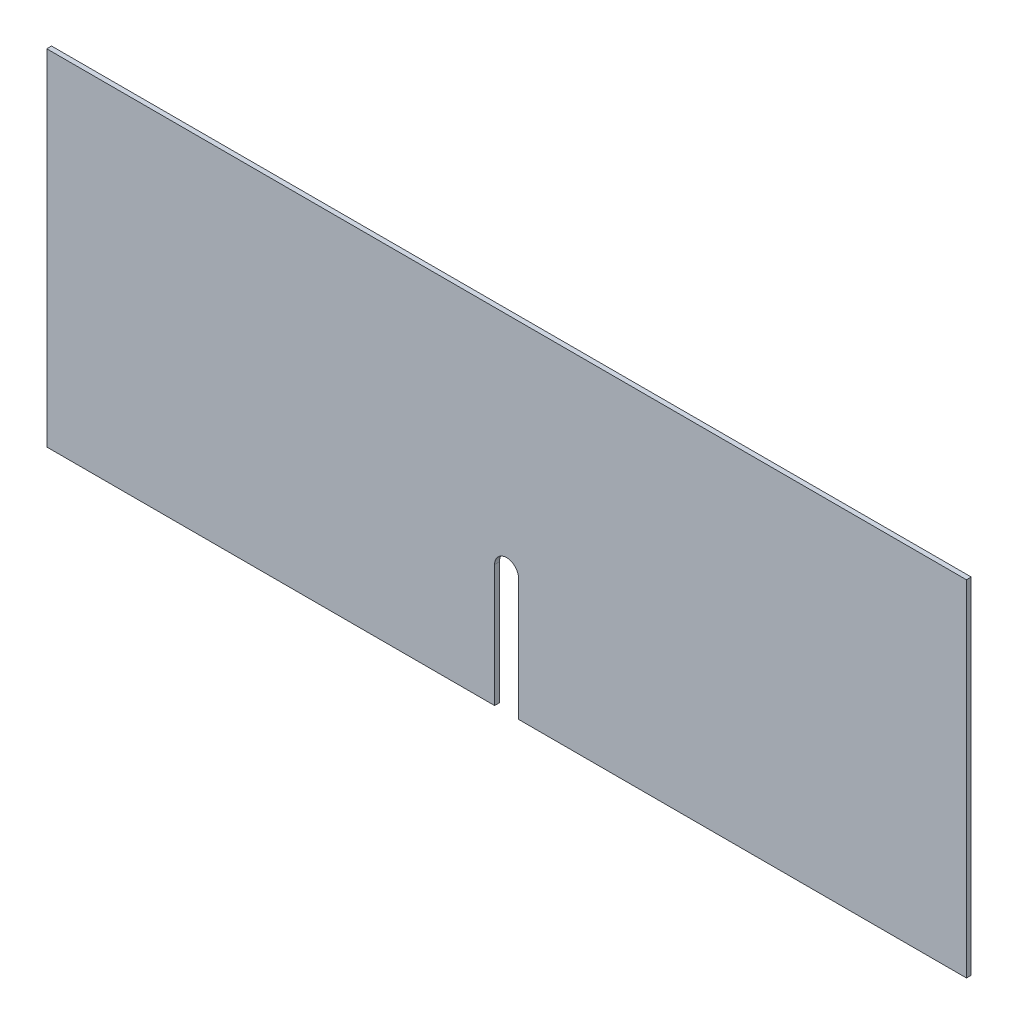
ISO-10303-21;
HEADER;
FILE_DESCRIPTION(('STEP AP214'),'2;1');
FILE_NAME('part.step','',(''),(''),'','','');
FILE_SCHEMA(('AUTOMOTIVE_DESIGN { 1 0 10303 214 1 1 1 1 }'));
ENDSEC;
DATA;
#1=APPLICATION_CONTEXT('core data for automotive mechanical design processes');
#2=APPLICATION_PROTOCOL_DEFINITION('international standard','automotive_design',2000,#1);
#3=PRODUCT_CONTEXT('',#1,'mechanical');
#4=PRODUCT('Part','Part','',(#3));
#5=PRODUCT_RELATED_PRODUCT_CATEGORY('part','',(#4));
#6=PRODUCT_DEFINITION_FORMATION('','',#4);
#7=PRODUCT_DEFINITION_CONTEXT('part definition',#1,'design');
#8=PRODUCT_DEFINITION('design','',#6,#7);
#9=PRODUCT_DEFINITION_SHAPE('','',#8);
#10=(LENGTH_UNIT() NAMED_UNIT(*) SI_UNIT(.MILLI.,.METRE.));
#11=(NAMED_UNIT(*) PLANE_ANGLE_UNIT() SI_UNIT($,.RADIAN.));
#12=(NAMED_UNIT(*) SI_UNIT($,.STERADIAN.) SOLID_ANGLE_UNIT());
#13=UNCERTAINTY_MEASURE_WITH_UNIT(LENGTH_MEASURE(1.E-05),#10,'distance_accuracy_value','');
#14=(GEOMETRIC_REPRESENTATION_CONTEXT(3) GLOBAL_UNCERTAINTY_ASSIGNED_CONTEXT((#13)) GLOBAL_UNIT_ASSIGNED_CONTEXT((#10,
#11,#12)) REPRESENTATION_CONTEXT('',''));
#15=CARTESIAN_POINT('',(0.,0.,0.));
#16=DIRECTION('',(0.,0.,1.));
#17=DIRECTION('',(1.,0.,0.));
#18=AXIS2_PLACEMENT_3D('',#15,#16,#17);
#19=CARTESIAN_POINT('',(277.715474090151,-96.8844194508236,0.));
#20=DIRECTION('',(0.,0.,1.));
#21=DIRECTION('',(1.,0.,0.));
#22=AXIS2_PLACEMENT_3D('',#19,#20,#21);
#23=PLANE('',#22);
#24=DIRECTION('',(1.,0.,0.));
#25=VECTOR('',#24,1.);
#26=CARTESIAN_POINT('',(582.515474090151,-205.307848770144,0.));
#27=LINE('',#26,#25);
#28=CARTESIAN_POINT('',(285.652974090151,-205.307848770144,0.));
#29=VERTEX_POINT('',#28);
#30=CARTESIAN_POINT('',(582.515474090151,-205.307848770144,0.));
#31=VERTEX_POINT('',#30);
#32=EDGE_CURVE('E85',#29,#31,#27,.T.);
#33=ORIENTED_EDGE('',*,*,#32,.F.);
#34=DIRECTION('',(0.,1.,0.));
#35=VECTOR('',#34,1.);
#36=CARTESIAN_POINT('',(285.652974090151,-205.307848770144,0.));
#37=LINE('',#36,#35);
#38=CARTESIAN_POINT('',(285.652974090151,-124.345348770144,0.));
#39=VERTEX_POINT('',#38);
#40=EDGE_CURVE('E53',#39,#29,#37,.F.);
#41=ORIENTED_EDGE('',*,*,#40,.F.);
#42=CARTESIAN_POINT('',(277.715474090151,-124.345348770144,0.));
#43=DIRECTION('',(0.,0.,1.));
#44=DIRECTION('',(1.,0.,0.));
#45=AXIS2_PLACEMENT_3D('',#42,#43,#44);
#46=CIRCLE('',#45,7.9375);
#47=CARTESIAN_POINT('',(269.777974090151,-124.345348770144,0.));
#48=VERTEX_POINT('',#47);
#49=EDGE_CURVE('E20',#39,#48,#46,.T.);
#50=ORIENTED_EDGE('',*,*,#49,.T.);
#51=DIRECTION('',(0.,1.,0.));
#52=VECTOR('',#51,1.);
#53=CARTESIAN_POINT('',(269.777974090151,-124.345348770144,0.));
#54=LINE('',#53,#52);
#55=CARTESIAN_POINT('',(269.777974090151,-205.307848770144,0.));
#56=VERTEX_POINT('',#55);
#57=EDGE_CURVE('E59',#56,#48,#54,.T.);
#58=ORIENTED_EDGE('',*,*,#57,.F.);
#59=DIRECTION('',(1.,0.,0.));
#60=VECTOR('',#59,1.);
#61=CARTESIAN_POINT('',(269.777974090151,-205.307848770144,0.));
#62=LINE('',#61,#60);
#63=CARTESIAN_POINT('',(-27.0845259098492,-205.307848770144,0.));
#64=VERTEX_POINT('',#63);
#65=EDGE_CURVE('E118',#64,#56,#62,.T.);
#66=ORIENTED_EDGE('',*,*,#65,.F.);
#67=DIRECTION('',(0.,1.,0.));
#68=VECTOR('',#67,1.);
#69=CARTESIAN_POINT('',(-27.0845259098492,-205.307848770144,0.));
#70=LINE('',#69,#68);
#71=CARTESIAN_POINT('',(-27.0845259098492,23.2921512298557,0.));
#72=VERTEX_POINT('',#71);
#73=EDGE_CURVE('E123',#72,#64,#70,.F.);
#74=ORIENTED_EDGE('',*,*,#73,.F.);
#75=DIRECTION('',(1.,0.,0.));
#76=VECTOR('',#75,1.);
#77=CARTESIAN_POINT('',(-27.0845259098492,23.2921512298557,0.));
#78=LINE('',#77,#76);
#79=CARTESIAN_POINT('',(582.515474090151,23.2921512298557,0.));
#80=VERTEX_POINT('',#79);
#81=EDGE_CURVE('E129',#80,#72,#78,.F.);
#82=ORIENTED_EDGE('',*,*,#81,.F.);
#83=DIRECTION('',(0.,1.,0.));
#84=VECTOR('',#83,1.);
#85=CARTESIAN_POINT('',(582.515474090151,23.2921512298557,0.));
#86=LINE('',#85,#84);
#87=EDGE_CURVE('E83',#31,#80,#86,.T.);
#88=ORIENTED_EDGE('',*,*,#87,.F.);
#89=EDGE_LOOP('',(#33,#41,#50,#58,#66,#74,#82,#88));
#90=FACE_BOUND('',#89,.T.);
#91=ADVANCED_FACE('F17',(#90),#23,.F.);
#92=CARTESIAN_POINT('',(285.652974090151,-205.307848770144,0.));
#93=DIRECTION('',(-1.,0.,0.));
#94=DIRECTION('',(0.,0.,1.));
#95=AXIS2_PLACEMENT_3D('',#92,#93,#94);
#96=PLANE('',#95);
#97=DIRECTION('',(0.,1.,0.));
#98=VECTOR('',#97,1.);
#99=CARTESIAN_POINT('',(285.652974090151,-96.8844194508236,3.175));
#100=LINE('',#99,#98);
#101=CARTESIAN_POINT('',(285.652974090151,-124.345348770144,3.175));
#102=VERTEX_POINT('',#101);
#103=CARTESIAN_POINT('',(285.652974090151,-205.307848770144,3.175));
#104=VERTEX_POINT('',#103);
#105=EDGE_CURVE('E150',#102,#104,#100,.F.);
#106=ORIENTED_EDGE('',*,*,#105,.F.);
#107=DIRECTION('',(0.,0.,1.));
#108=VECTOR('',#107,1.);
#109=CARTESIAN_POINT('',(285.652974090151,-124.345348770144,0.));
#110=LINE('',#109,#108);
#111=EDGE_CURVE('E95',#102,#39,#110,.F.);
#112=ORIENTED_EDGE('',*,*,#111,.T.);
#113=ORIENTED_EDGE('',*,*,#40,.T.);
#114=DIRECTION('',(0.,0.,-1.));
#115=VECTOR('',#114,1.);
#116=CARTESIAN_POINT('',(285.652974090151,-205.307848770144,0.));
#117=LINE('',#116,#115);
#118=EDGE_CURVE('E89',#104,#29,#117,.T.);
#119=ORIENTED_EDGE('',*,*,#118,.F.);
#120=EDGE_LOOP('',(#106,#112,#113,#119));
#121=FACE_BOUND('',#120,.T.);
#122=ADVANCED_FACE('F92',(#121),#96,.T.);
#123=CARTESIAN_POINT('',(582.515474090151,-205.307848770144,0.));
#124=DIRECTION('',(0.,-1.,0.));
#125=DIRECTION('',(0.,0.,-1.));
#126=AXIS2_PLACEMENT_3D('',#123,#124,#125);
#127=PLANE('',#126);
#128=DIRECTION('',(1.,0.,0.));
#129=VECTOR('',#128,1.);
#130=CARTESIAN_POINT('',(277.715474090151,-205.307848770144,3.175));
#131=LINE('',#130,#129);
#132=CARTESIAN_POINT('',(582.515474090151,-205.307848770144,3.175));
#133=VERTEX_POINT('',#132);
#134=EDGE_CURVE('E100',#104,#133,#131,.T.);
#135=ORIENTED_EDGE('',*,*,#134,.F.);
#136=ORIENTED_EDGE('',*,*,#118,.T.);
#137=ORIENTED_EDGE('',*,*,#32,.T.);
#138=DIRECTION('',(0.,0.,-1.));
#139=VECTOR('',#138,1.);
#140=CARTESIAN_POINT('',(582.515474090151,-205.307848770144,0.));
#141=LINE('',#140,#139);
#142=EDGE_CURVE('E103',#133,#31,#141,.T.);
#143=ORIENTED_EDGE('',*,*,#142,.F.);
#144=EDGE_LOOP('',(#135,#136,#137,#143));
#145=FACE_BOUND('',#144,.T.);
#146=ADVANCED_FACE('F98',(#145),#127,.T.);
#147=CARTESIAN_POINT('',(582.515474090151,23.2921512298557,0.));
#148=DIRECTION('',(1.,0.,0.));
#149=DIRECTION('',(0.,0.,-1.));
#150=AXIS2_PLACEMENT_3D('',#147,#148,#149);
#151=PLANE('',#150);
#152=DIRECTION('',(0.,1.,0.));
#153=VECTOR('',#152,1.);
#154=CARTESIAN_POINT('',(582.515474090151,-96.8844194508236,3.175));
#155=LINE('',#154,#153);
#156=CARTESIAN_POINT('',(582.515474090151,23.2921512298557,3.175));
#157=VERTEX_POINT('',#156);
#158=EDGE_CURVE('E149',#133,#157,#155,.T.);
#159=ORIENTED_EDGE('',*,*,#158,.F.);
#160=ORIENTED_EDGE('',*,*,#142,.T.);
#161=ORIENTED_EDGE('',*,*,#87,.T.);
#162=DIRECTION('',(0.,0.,1.));
#163=VECTOR('',#162,1.);
#164=CARTESIAN_POINT('',(582.515474090151,23.2921512298557,0.));
#165=LINE('',#164,#163);
#166=EDGE_CURVE('E126',#157,#80,#165,.F.);
#167=ORIENTED_EDGE('',*,*,#166,.F.);
#168=EDGE_LOOP('',(#159,#160,#161,#167));
#169=FACE_BOUND('',#168,.T.);
#170=ADVANCED_FACE('F219',(#169),#151,.T.);
#171=CARTESIAN_POINT('',(-27.0845259098492,23.2921512298557,0.));
#172=DIRECTION('',(0.,1.,0.));
#173=DIRECTION('',(0.,0.,1.));
#174=AXIS2_PLACEMENT_3D('',#171,#172,#173);
#175=PLANE('',#174);
#176=DIRECTION('',(1.,0.,0.));
#177=VECTOR('',#176,1.);
#178=CARTESIAN_POINT('',(277.715474090151,23.2921512298557,3.175));
#179=LINE('',#178,#177);
#180=CARTESIAN_POINT('',(-27.0845259098492,23.2921512298557,3.175));
#181=VERTEX_POINT('',#180);
#182=EDGE_CURVE('E153',#157,#181,#179,.F.);
#183=ORIENTED_EDGE('',*,*,#182,.F.);
#184=ORIENTED_EDGE('',*,*,#166,.T.);
#185=ORIENTED_EDGE('',*,*,#81,.T.);
#186=DIRECTION('',(0.,0.,1.));
#187=VECTOR('',#186,1.);
#188=CARTESIAN_POINT('',(-27.0845259098492,23.2921512298557,0.));
#189=LINE('',#188,#187);
#190=EDGE_CURVE('E120',#181,#72,#189,.F.);
#191=ORIENTED_EDGE('',*,*,#190,.F.);
#192=EDGE_LOOP('',(#183,#184,#185,#191));
#193=FACE_BOUND('',#192,.T.);
#194=ADVANCED_FACE('F193',(#193),#175,.T.);
#195=CARTESIAN_POINT('',(-27.0845259098492,-205.307848770144,0.));
#196=DIRECTION('',(-1.,0.,0.));
#197=DIRECTION('',(0.,0.,1.));
#198=AXIS2_PLACEMENT_3D('',#195,#196,#197);
#199=PLANE('',#198);
#200=DIRECTION('',(0.,1.,0.));
#201=VECTOR('',#200,1.);
#202=CARTESIAN_POINT('',(-27.0845259098492,-96.8844194508236,3.175));
#203=LINE('',#202,#201);
#204=CARTESIAN_POINT('',(-27.0845259098492,-205.307848770144,3.175));
#205=VERTEX_POINT('',#204);
#206=EDGE_CURVE('E170',#181,#205,#203,.F.);
#207=ORIENTED_EDGE('',*,*,#206,.F.);
#208=ORIENTED_EDGE('',*,*,#190,.T.);
#209=ORIENTED_EDGE('',*,*,#73,.T.);
#210=DIRECTION('',(0.,0.,-1.));
#211=VECTOR('',#210,1.);
#212=CARTESIAN_POINT('',(-27.0845259098492,-205.307848770144,0.));
#213=LINE('',#212,#211);
#214=EDGE_CURVE('E113',#205,#64,#213,.T.);
#215=ORIENTED_EDGE('',*,*,#214,.F.);
#216=EDGE_LOOP('',(#207,#208,#209,#215));
#217=FACE_BOUND('',#216,.T.);
#218=ADVANCED_FACE('F196',(#217),#199,.T.);
#219=CARTESIAN_POINT('',(269.777974090151,-205.307848770144,0.));
#220=DIRECTION('',(0.,-1.,0.));
#221=DIRECTION('',(0.,0.,-1.));
#222=AXIS2_PLACEMENT_3D('',#219,#220,#221);
#223=PLANE('',#222);
#224=DIRECTION('',(1.,0.,0.));
#225=VECTOR('',#224,1.);
#226=CARTESIAN_POINT('',(277.715474090151,-205.307848770144,3.175));
#227=LINE('',#226,#225);
#228=CARTESIAN_POINT('',(269.777974090151,-205.307848770144,3.175));
#229=VERTEX_POINT('',#228);
#230=EDGE_CURVE('E167',#205,#229,#227,.T.);
#231=ORIENTED_EDGE('',*,*,#230,.F.);
#232=ORIENTED_EDGE('',*,*,#214,.T.);
#233=ORIENTED_EDGE('',*,*,#65,.T.);
#234=DIRECTION('',(0.,0.,-1.));
#235=VECTOR('',#234,1.);
#236=CARTESIAN_POINT('',(269.777974090151,-205.307848770144,0.));
#237=LINE('',#236,#235);
#238=EDGE_CURVE('E112',#229,#56,#237,.T.);
#239=ORIENTED_EDGE('',*,*,#238,.F.);
#240=EDGE_LOOP('',(#231,#232,#233,#239));
#241=FACE_BOUND('',#240,.T.);
#242=ADVANCED_FACE('F199',(#241),#223,.T.);
#243=CARTESIAN_POINT('',(269.777974090151,-124.345348770144,0.));
#244=DIRECTION('',(1.,0.,0.));
#245=DIRECTION('',(0.,0.,-1.));
#246=AXIS2_PLACEMENT_3D('',#243,#244,#245);
#247=PLANE('',#246);
#248=DIRECTION('',(0.,1.,0.));
#249=VECTOR('',#248,1.);
#250=CARTESIAN_POINT('',(269.777974090151,-96.8844194508236,3.175));
#251=LINE('',#250,#249);
#252=CARTESIAN_POINT('',(269.777974090151,-124.345348770144,3.175));
#253=VERTEX_POINT('',#252);
#254=EDGE_CURVE('E26',#229,#253,#251,.T.);
#255=ORIENTED_EDGE('',*,*,#254,.F.);
#256=ORIENTED_EDGE('',*,*,#238,.T.);
#257=ORIENTED_EDGE('',*,*,#57,.T.);
#258=DIRECTION('',(0.,0.,1.));
#259=VECTOR('',#258,1.);
#260=CARTESIAN_POINT('',(269.777974090151,-124.345348770144,0.));
#261=LINE('',#260,#259);
#262=EDGE_CURVE('E34',#48,#253,#261,.T.);
#263=ORIENTED_EDGE('',*,*,#262,.T.);
#264=EDGE_LOOP('',(#255,#256,#257,#263));
#265=FACE_BOUND('',#264,.T.);
#266=ADVANCED_FACE('F200',(#265),#247,.T.);
#267=CARTESIAN_POINT('',(277.715474090151,-124.345348770144,0.));
#268=DIRECTION('',(0.,0.,1.));
#269=DIRECTION('',(1.,0.,0.));
#270=AXIS2_PLACEMENT_3D('',#267,#268,#269);
#271=CYLINDRICAL_SURFACE('',#270,7.9375);
#272=ORIENTED_EDGE('',*,*,#49,.F.);
#273=ORIENTED_EDGE('',*,*,#111,.F.);
#274=CARTESIAN_POINT('',(277.715474090151,-124.345348770144,3.175));
#275=DIRECTION('',(0.,0.,1.));
#276=DIRECTION('',(1.,0.,0.));
#277=AXIS2_PLACEMENT_3D('',#274,#275,#276);
#278=CIRCLE('',#277,7.9375);
#279=EDGE_CURVE('E11',#253,#102,#278,.F.);
#280=ORIENTED_EDGE('',*,*,#279,.F.);
#281=ORIENTED_EDGE('',*,*,#262,.F.);
#282=EDGE_LOOP('',(#272,#273,#280,#281));
#283=FACE_BOUND('',#282,.T.);
#284=ADVANCED_FACE('F202',(#283),#271,.F.);
#285=CARTESIAN_POINT('',(277.715474090151,-96.8844194508236,3.175));
#286=DIRECTION('',(0.,0.,1.));
#287=DIRECTION('',(1.,0.,0.));
#288=AXIS2_PLACEMENT_3D('',#285,#286,#287);
#289=PLANE('',#288);
#290=ORIENTED_EDGE('',*,*,#254,.T.);
#291=ORIENTED_EDGE('',*,*,#279,.T.);
#292=ORIENTED_EDGE('',*,*,#105,.T.);
#293=ORIENTED_EDGE('',*,*,#134,.T.);
#294=ORIENTED_EDGE('',*,*,#158,.T.);
#295=ORIENTED_EDGE('',*,*,#182,.T.);
#296=ORIENTED_EDGE('',*,*,#206,.T.);
#297=ORIENTED_EDGE('',*,*,#230,.T.);
#298=EDGE_LOOP('',(#290,#291,#292,#293,#294,#295,#296,#297));
#299=FACE_BOUND('',#298,.T.);
#300=ADVANCED_FACE('F191',(#299),#289,.T.);
#301=CLOSED_SHELL('',(#91,#122,#146,#170,#194,#218,#242,#266,#284,#300));
#302=MANIFOLD_SOLID_BREP('B1',#301);
#303=ADVANCED_BREP_SHAPE_REPRESENTATION('',(#18,#302),#14);
#304=SHAPE_DEFINITION_REPRESENTATION(#9,#303);
ENDSEC;
END-ISO-10303-21;
